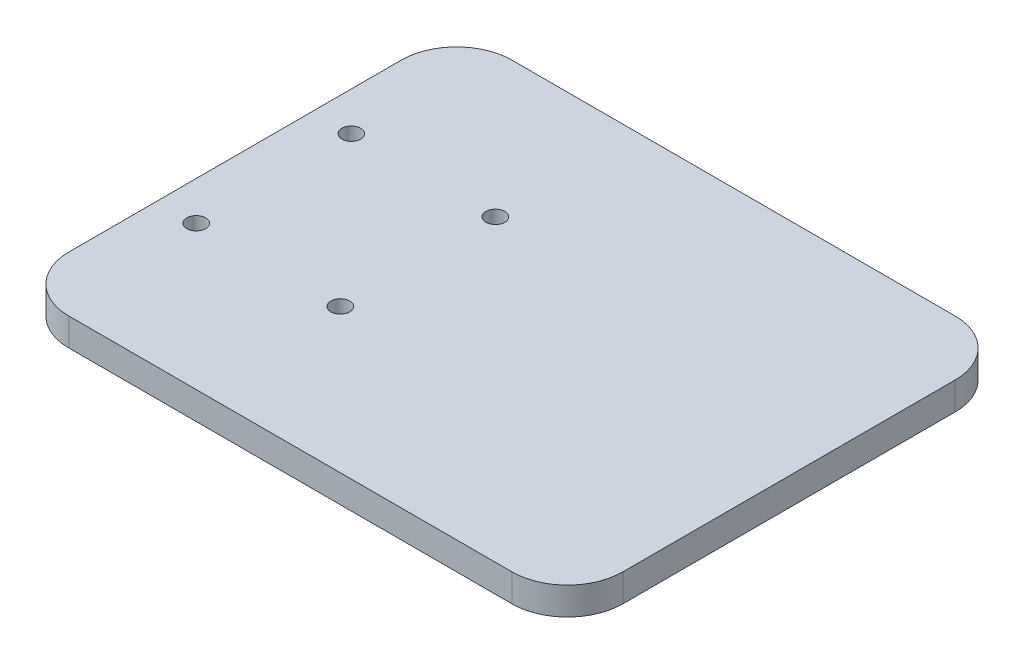
ISO-10303-21;
HEADER;
FILE_DESCRIPTION(('STEP AP214'),'2;1');
FILE_NAME('part.step','',(''),(''),'','','');
FILE_SCHEMA(('AUTOMOTIVE_DESIGN { 1 0 10303 214 1 1 1 1 }'));
ENDSEC;
DATA;
#1=APPLICATION_CONTEXT('core data for automotive mechanical design processes');
#2=APPLICATION_PROTOCOL_DEFINITION('international standard','automotive_design',2000,#1);
#3=PRODUCT_CONTEXT('',#1,'mechanical');
#4=PRODUCT('Part','Part','',(#3));
#5=PRODUCT_RELATED_PRODUCT_CATEGORY('part','',(#4));
#6=PRODUCT_DEFINITION_FORMATION('','',#4);
#7=PRODUCT_DEFINITION_CONTEXT('part definition',#1,'design');
#8=PRODUCT_DEFINITION('design','',#6,#7);
#9=PRODUCT_DEFINITION_SHAPE('','',#8);
#10=(LENGTH_UNIT() NAMED_UNIT(*) SI_UNIT(.MILLI.,.METRE.));
#11=(NAMED_UNIT(*) PLANE_ANGLE_UNIT() SI_UNIT($,.RADIAN.));
#12=(NAMED_UNIT(*) SI_UNIT($,.STERADIAN.) SOLID_ANGLE_UNIT());
#13=UNCERTAINTY_MEASURE_WITH_UNIT(LENGTH_MEASURE(1.E-05),#10,'distance_accuracy_value','');
#14=(GEOMETRIC_REPRESENTATION_CONTEXT(3) GLOBAL_UNCERTAINTY_ASSIGNED_CONTEXT((#13)) GLOBAL_UNIT_ASSIGNED_CONTEXT((#10,
#11,#12)) REPRESENTATION_CONTEXT('',''));
#15=CARTESIAN_POINT('',(0.,0.,0.));
#16=DIRECTION('',(0.,0.,1.));
#17=DIRECTION('',(1.,0.,0.));
#18=AXIS2_PLACEMENT_3D('',#15,#16,#17);
#19=CARTESIAN_POINT('',(0.,-5.,0.));
#20=DIRECTION('',(0.,1.,0.));
#21=DIRECTION('',(0.,0.,1.));
#22=AXIS2_PLACEMENT_3D('',#19,#20,#21);
#23=PLANE('',#22);
#24=CARTESIAN_POINT('',(13.,-5.,14.));
#25=DIRECTION('',(0.,1.,0.));
#26=DIRECTION('',(0.,0.,1.));
#27=AXIS2_PLACEMENT_3D('',#24,#25,#26);
#28=CIRCLE('',#27,1.69999999999999);
#29=CARTESIAN_POINT('',(13.,-5.,15.7));
#30=VERTEX_POINT('',#29);
#31=EDGE_CURVE('E267',#30,#30,#28,.F.);
#32=ORIENTED_EDGE('',*,*,#31,.F.);
#33=EDGE_LOOP('',(#32));
#34=FACE_BOUND('',#33,.T.);
#35=CARTESIAN_POINT('',(-13.,-5.,14.));
#36=DIRECTION('',(0.,1.,0.));
#37=DIRECTION('',(0.,0.,1.));
#38=AXIS2_PLACEMENT_3D('',#35,#36,#37);
#39=CIRCLE('',#38,1.69999999999999);
#40=CARTESIAN_POINT('',(-13.,-5.,15.7));
#41=VERTEX_POINT('',#40);
#42=EDGE_CURVE('E194',#41,#41,#39,.F.);
#43=ORIENTED_EDGE('',*,*,#42,.F.);
#44=EDGE_LOOP('',(#43));
#45=FACE_BOUND('',#44,.T.);
#46=DIRECTION('',(0.,0.,1.));
#47=VECTOR('',#46,1.);
#48=CARTESIAN_POINT('',(80.,-5.,-40.));
#49=LINE('',#48,#47);
#50=CARTESIAN_POINT('',(80.,-5.,-30.));
#51=VERTEX_POINT('',#50);
#52=CARTESIAN_POINT('',(80.,-5.,30.));
#53=VERTEX_POINT('',#52);
#54=EDGE_CURVE('E138',#51,#53,#49,.T.);
#55=ORIENTED_EDGE('',*,*,#54,.T.);
#56=CARTESIAN_POINT('',(70.,-5.,30.));
#57=DIRECTION('',(0.,1.,0.));
#58=DIRECTION('',(0.,0.,1.));
#59=AXIS2_PLACEMENT_3D('',#56,#57,#58);
#60=CIRCLE('',#59,10.);
#61=CARTESIAN_POINT('',(70.,-5.,40.));
#62=VERTEX_POINT('',#61);
#63=EDGE_CURVE('E166',#53,#62,#60,.F.);
#64=ORIENTED_EDGE('',*,*,#63,.T.);
#65=DIRECTION('',(1.,0.,0.));
#66=VECTOR('',#65,1.);
#67=CARTESIAN_POINT('',(-20.,-5.,40.));
#68=LINE('',#67,#66);
#69=CARTESIAN_POINT('',(-10.,-5.,40.));
#70=VERTEX_POINT('',#69);
#71=EDGE_CURVE('E181',#70,#62,#68,.T.);
#72=ORIENTED_EDGE('',*,*,#71,.F.);
#73=CARTESIAN_POINT('',(-10.,-5.,30.));
#74=DIRECTION('',(0.,1.,0.));
#75=DIRECTION('',(0.,0.,1.));
#76=AXIS2_PLACEMENT_3D('',#73,#74,#75);
#77=CIRCLE('',#76,10.);
#78=CARTESIAN_POINT('',(-20.,-5.,30.));
#79=VERTEX_POINT('',#78);
#80=EDGE_CURVE('E131',#70,#79,#77,.F.);
#81=ORIENTED_EDGE('',*,*,#80,.T.);
#82=DIRECTION('',(0.,0.,1.));
#83=VECTOR('',#82,1.);
#84=CARTESIAN_POINT('',(-20.,-5.,-40.));
#85=LINE('',#84,#83);
#86=CARTESIAN_POINT('',(-20.,-5.,-30.));
#87=VERTEX_POINT('',#86);
#88=EDGE_CURVE('E179',#87,#79,#85,.T.);
#89=ORIENTED_EDGE('',*,*,#88,.F.);
#90=CARTESIAN_POINT('',(-10.,-5.,-30.));
#91=DIRECTION('',(0.,1.,0.));
#92=DIRECTION('',(0.,0.,1.));
#93=AXIS2_PLACEMENT_3D('',#90,#91,#92);
#94=CIRCLE('',#93,10.);
#95=CARTESIAN_POINT('',(-10.,-5.,-40.));
#96=VERTEX_POINT('',#95);
#97=EDGE_CURVE('E62',#87,#96,#94,.F.);
#98=ORIENTED_EDGE('',*,*,#97,.T.);
#99=DIRECTION('',(1.,0.,0.));
#100=VECTOR('',#99,1.);
#101=CARTESIAN_POINT('',(-20.,-5.,-40.));
#102=LINE('',#101,#100);
#103=CARTESIAN_POINT('',(70.,-5.,-40.));
#104=VERTEX_POINT('',#103);
#105=EDGE_CURVE('E133',#96,#104,#102,.T.);
#106=ORIENTED_EDGE('',*,*,#105,.T.);
#107=CARTESIAN_POINT('',(70.,-5.,-30.));
#108=DIRECTION('',(0.,1.,0.));
#109=DIRECTION('',(0.,0.,1.));
#110=AXIS2_PLACEMENT_3D('',#107,#108,#109);
#111=CIRCLE('',#110,10.);
#112=EDGE_CURVE('E163',#104,#51,#111,.F.);
#113=ORIENTED_EDGE('',*,*,#112,.T.);
#114=EDGE_LOOP('',(#55,#64,#72,#81,#89,#98,#106,#113));
#115=FACE_BOUND('',#114,.T.);
#116=CARTESIAN_POINT('',(13.,-5.,-14.));
#117=DIRECTION('',(0.,1.,0.));
#118=DIRECTION('',(0.,0.,1.));
#119=AXIS2_PLACEMENT_3D('',#116,#117,#118);
#120=CIRCLE('',#119,1.69999999999999);
#121=CARTESIAN_POINT('',(13.,-5.,-12.3));
#122=VERTEX_POINT('',#121);
#123=EDGE_CURVE('E273',#122,#122,#120,.F.);
#124=ORIENTED_EDGE('',*,*,#123,.F.);
#125=EDGE_LOOP('',(#124));
#126=FACE_BOUND('',#125,.T.);
#127=CARTESIAN_POINT('',(-13.,-5.,-14.));
#128=DIRECTION('',(0.,1.,0.));
#129=DIRECTION('',(0.,0.,1.));
#130=AXIS2_PLACEMENT_3D('',#127,#128,#129);
#131=CIRCLE('',#130,1.69999999999999);
#132=CARTESIAN_POINT('',(-13.,-5.,-12.3));
#133=VERTEX_POINT('',#132);
#134=EDGE_CURVE('E292',#133,#133,#131,.F.);
#135=ORIENTED_EDGE('',*,*,#134,.F.);
#136=EDGE_LOOP('',(#135));
#137=FACE_BOUND('',#136,.T.);
#138=ADVANCED_FACE('F39',(#34,#45,#115,#126,#137),#23,.F.);
#139=CARTESIAN_POINT('',(-20.,-5.,-40.));
#140=DIRECTION('',(-1.,0.,0.));
#141=DIRECTION('',(0.,0.,1.));
#142=AXIS2_PLACEMENT_3D('',#139,#140,#141);
#143=PLANE('',#142);
#144=DIRECTION('',(0.,0.,1.));
#145=VECTOR('',#144,1.);
#146=CARTESIAN_POINT('',(-20.,0.,-40.));
#147=LINE('',#146,#145);
#148=CARTESIAN_POINT('',(-20.,0.,-30.));
#149=VERTEX_POINT('',#148);
#150=CARTESIAN_POINT('',(-20.,0.,30.));
#151=VERTEX_POINT('',#150);
#152=EDGE_CURVE('E111',#149,#151,#147,.T.);
#153=ORIENTED_EDGE('',*,*,#152,.F.);
#154=DIRECTION('',(0.,1.,0.));
#155=VECTOR('',#154,1.);
#156=CARTESIAN_POINT('',(-20.,-5.,-30.));
#157=LINE('',#156,#155);
#158=EDGE_CURVE('E11',#149,#87,#157,.F.);
#159=ORIENTED_EDGE('',*,*,#158,.T.);
#160=ORIENTED_EDGE('',*,*,#88,.T.);
#161=DIRECTION('',(0.,1.,0.));
#162=VECTOR('',#161,1.);
#163=CARTESIAN_POINT('',(-20.,-5.,30.));
#164=LINE('',#163,#162);
#165=EDGE_CURVE('E48',#79,#151,#164,.T.);
#166=ORIENTED_EDGE('',*,*,#165,.T.);
#167=EDGE_LOOP('',(#153,#159,#160,#166));
#168=FACE_BOUND('',#167,.T.);
#169=ADVANCED_FACE('F177',(#168),#143,.T.);
#170=CARTESIAN_POINT('',(-20.,-5.,-40.));
#171=DIRECTION('',(0.,0.,1.));
#172=DIRECTION('',(1.,0.,0.));
#173=AXIS2_PLACEMENT_3D('',#170,#171,#172);
#174=PLANE('',#173);
#175=DIRECTION('',(1.,0.,0.));
#176=VECTOR('',#175,1.);
#177=CARTESIAN_POINT('',(-20.,0.,-40.));
#178=LINE('',#177,#176);
#179=CARTESIAN_POINT('',(-10.,0.,-40.));
#180=VERTEX_POINT('',#179);
#181=CARTESIAN_POINT('',(70.,0.,-40.));
#182=VERTEX_POINT('',#181);
#183=EDGE_CURVE('E141',#180,#182,#178,.T.);
#184=ORIENTED_EDGE('',*,*,#183,.T.);
#185=DIRECTION('',(0.,1.,0.));
#186=VECTOR('',#185,1.);
#187=CARTESIAN_POINT('',(70.,-5.,-40.));
#188=LINE('',#187,#186);
#189=EDGE_CURVE('E55',#182,#104,#188,.F.);
#190=ORIENTED_EDGE('',*,*,#189,.T.);
#191=ORIENTED_EDGE('',*,*,#105,.F.);
#192=DIRECTION('',(0.,1.,0.));
#193=VECTOR('',#192,1.);
#194=CARTESIAN_POINT('',(-10.,0.,-40.));
#195=LINE('',#194,#193);
#196=EDGE_CURVE('E169',#96,#180,#195,.T.);
#197=ORIENTED_EDGE('',*,*,#196,.T.);
#198=EDGE_LOOP('',(#184,#190,#191,#197));
#199=FACE_BOUND('',#198,.T.);
#200=ADVANCED_FACE('F211',(#199),#174,.F.);
#201=CARTESIAN_POINT('',(80.,-5.,-40.));
#202=DIRECTION('',(-1.,0.,0.));
#203=DIRECTION('',(0.,0.,1.));
#204=AXIS2_PLACEMENT_3D('',#201,#202,#203);
#205=PLANE('',#204);
#206=DIRECTION('',(0.,0.,1.));
#207=VECTOR('',#206,1.);
#208=CARTESIAN_POINT('',(80.,0.,-40.));
#209=LINE('',#208,#207);
#210=CARTESIAN_POINT('',(80.,0.,-30.));
#211=VERTEX_POINT('',#210);
#212=CARTESIAN_POINT('',(80.,0.,30.));
#213=VERTEX_POINT('',#212);
#214=EDGE_CURVE('E128',#211,#213,#209,.T.);
#215=ORIENTED_EDGE('',*,*,#214,.T.);
#216=DIRECTION('',(0.,1.,0.));
#217=VECTOR('',#216,1.);
#218=CARTESIAN_POINT('',(80.,-5.,30.));
#219=LINE('',#218,#217);
#220=EDGE_CURVE('E156',#213,#53,#219,.F.);
#221=ORIENTED_EDGE('',*,*,#220,.T.);
#222=ORIENTED_EDGE('',*,*,#54,.F.);
#223=DIRECTION('',(0.,1.,0.));
#224=VECTOR('',#223,1.);
#225=CARTESIAN_POINT('',(80.,-5.,-30.));
#226=LINE('',#225,#224);
#227=EDGE_CURVE('E152',#51,#211,#226,.T.);
#228=ORIENTED_EDGE('',*,*,#227,.T.);
#229=EDGE_LOOP('',(#215,#221,#222,#228));
#230=FACE_BOUND('',#229,.T.);
#231=ADVANCED_FACE('F200',(#230),#205,.F.);
#232=CARTESIAN_POINT('',(-20.,-5.,40.));
#233=DIRECTION('',(0.,0.,1.));
#234=DIRECTION('',(1.,0.,0.));
#235=AXIS2_PLACEMENT_3D('',#232,#233,#234);
#236=PLANE('',#235);
#237=ORIENTED_EDGE('',*,*,#71,.T.);
#238=DIRECTION('',(0.,1.,0.));
#239=VECTOR('',#238,1.);
#240=CARTESIAN_POINT('',(70.,0.,40.));
#241=LINE('',#240,#239);
#242=CARTESIAN_POINT('',(70.,0.,40.));
#243=VERTEX_POINT('',#242);
#244=EDGE_CURVE('E118',#62,#243,#241,.T.);
#245=ORIENTED_EDGE('',*,*,#244,.T.);
#246=DIRECTION('',(1.,0.,0.));
#247=VECTOR('',#246,1.);
#248=CARTESIAN_POINT('',(-20.,0.,40.));
#249=LINE('',#248,#247);
#250=CARTESIAN_POINT('',(-10.,0.,40.));
#251=VERTEX_POINT('',#250);
#252=EDGE_CURVE('E109',#251,#243,#249,.T.);
#253=ORIENTED_EDGE('',*,*,#252,.F.);
#254=DIRECTION('',(0.,1.,0.));
#255=VECTOR('',#254,1.);
#256=CARTESIAN_POINT('',(-10.,-5.,40.));
#257=LINE('',#256,#255);
#258=EDGE_CURVE('E124',#251,#70,#257,.F.);
#259=ORIENTED_EDGE('',*,*,#258,.T.);
#260=EDGE_LOOP('',(#237,#245,#253,#259));
#261=FACE_BOUND('',#260,.T.);
#262=ADVANCED_FACE('F123',(#261),#236,.T.);
#263=CARTESIAN_POINT('',(0.,0.,0.));
#264=DIRECTION('',(0.,1.,0.));
#265=DIRECTION('',(0.,0.,1.));
#266=AXIS2_PLACEMENT_3D('',#263,#264,#265);
#267=PLANE('',#266);
#268=CARTESIAN_POINT('',(-13.,0.,-14.));
#269=DIRECTION('',(0.,1.,0.));
#270=DIRECTION('',(0.,0.,1.));
#271=AXIS2_PLACEMENT_3D('',#268,#269,#270);
#272=CIRCLE('',#271,1.69999999999999);
#273=CARTESIAN_POINT('',(-13.,0.,-12.3));
#274=VERTEX_POINT('',#273);
#275=EDGE_CURVE('E294',#274,#274,#272,.T.);
#276=ORIENTED_EDGE('',*,*,#275,.F.);
#277=EDGE_LOOP('',(#276));
#278=FACE_BOUND('',#277,.T.);
#279=CARTESIAN_POINT('',(13.,0.,-14.));
#280=DIRECTION('',(0.,1.,0.));
#281=DIRECTION('',(0.,0.,1.));
#282=AXIS2_PLACEMENT_3D('',#279,#280,#281);
#283=CIRCLE('',#282,1.69999999999999);
#284=CARTESIAN_POINT('',(13.,0.,-12.3));
#285=VERTEX_POINT('',#284);
#286=EDGE_CURVE('E279',#285,#285,#283,.T.);
#287=ORIENTED_EDGE('',*,*,#286,.F.);
#288=EDGE_LOOP('',(#287));
#289=FACE_BOUND('',#288,.T.);
#290=CARTESIAN_POINT('',(13.,0.,14.));
#291=DIRECTION('',(0.,1.,0.));
#292=DIRECTION('',(0.,0.,1.));
#293=AXIS2_PLACEMENT_3D('',#290,#291,#292);
#294=CIRCLE('',#293,1.69999999999999);
#295=CARTESIAN_POINT('',(13.,0.,15.7));
#296=VERTEX_POINT('',#295);
#297=EDGE_CURVE('E270',#296,#296,#294,.T.);
#298=ORIENTED_EDGE('',*,*,#297,.F.);
#299=EDGE_LOOP('',(#298));
#300=FACE_BOUND('',#299,.T.);
#301=CARTESIAN_POINT('',(-13.,0.,14.));
#302=DIRECTION('',(0.,1.,0.));
#303=DIRECTION('',(0.,0.,1.));
#304=AXIS2_PLACEMENT_3D('',#301,#302,#303);
#305=CIRCLE('',#304,1.69999999999999);
#306=CARTESIAN_POINT('',(-13.,0.,15.7));
#307=VERTEX_POINT('',#306);
#308=EDGE_CURVE('E187',#307,#307,#305,.T.);
#309=ORIENTED_EDGE('',*,*,#308,.F.);
#310=EDGE_LOOP('',(#309));
#311=FACE_BOUND('',#310,.T.);
#312=ORIENTED_EDGE('',*,*,#252,.T.);
#313=CARTESIAN_POINT('',(70.,0.,30.));
#314=DIRECTION('',(0.,1.,0.));
#315=DIRECTION('',(0.,0.,1.));
#316=AXIS2_PLACEMENT_3D('',#313,#314,#315);
#317=CIRCLE('',#316,10.);
#318=EDGE_CURVE('E149',#243,#213,#317,.T.);
#319=ORIENTED_EDGE('',*,*,#318,.T.);
#320=ORIENTED_EDGE('',*,*,#214,.F.);
#321=CARTESIAN_POINT('',(70.,0.,-30.));
#322=DIRECTION('',(0.,1.,0.));
#323=DIRECTION('',(0.,0.,1.));
#324=AXIS2_PLACEMENT_3D('',#321,#322,#323);
#325=CIRCLE('',#324,10.);
#326=EDGE_CURVE('E146',#211,#182,#325,.T.);
#327=ORIENTED_EDGE('',*,*,#326,.T.);
#328=ORIENTED_EDGE('',*,*,#183,.F.);
#329=CARTESIAN_POINT('',(-10.,0.,-30.));
#330=DIRECTION('',(0.,1.,0.));
#331=DIRECTION('',(0.,0.,1.));
#332=AXIS2_PLACEMENT_3D('',#329,#330,#331);
#333=CIRCLE('',#332,10.);
#334=EDGE_CURVE('E117',#180,#149,#333,.T.);
#335=ORIENTED_EDGE('',*,*,#334,.T.);
#336=ORIENTED_EDGE('',*,*,#152,.T.);
#337=CARTESIAN_POINT('',(-10.,0.,30.));
#338=DIRECTION('',(0.,1.,0.));
#339=DIRECTION('',(0.,0.,1.));
#340=AXIS2_PLACEMENT_3D('',#337,#338,#339);
#341=CIRCLE('',#340,10.);
#342=EDGE_CURVE('E106',#151,#251,#341,.T.);
#343=ORIENTED_EDGE('',*,*,#342,.T.);
#344=EDGE_LOOP('',(#312,#319,#320,#327,#328,#335,#336,#343));
#345=FACE_BOUND('',#344,.T.);
#346=ADVANCED_FACE('F108',(#278,#289,#300,#311,#345),#267,.T.);
#347=CARTESIAN_POINT('',(-13.,0.,14.));
#348=DIRECTION('',(0.,1.,0.));
#349=DIRECTION('',(0.,0.,1.));
#350=AXIS2_PLACEMENT_3D('',#347,#348,#349);
#351=CYLINDRICAL_SURFACE('',#350,1.69999999999999);
#352=ORIENTED_EDGE('',*,*,#42,.T.);
#353=EDGE_LOOP('',(#352));
#354=FACE_BOUND('',#353,.T.);
#355=ORIENTED_EDGE('',*,*,#308,.T.);
#356=EDGE_LOOP('',(#355));
#357=FACE_BOUND('',#356,.T.);
#358=ADVANCED_FACE('F232',(#354,#357),#351,.F.);
#359=CARTESIAN_POINT('',(13.,0.,14.));
#360=DIRECTION('',(0.,1.,0.));
#361=DIRECTION('',(0.,0.,1.));
#362=AXIS2_PLACEMENT_3D('',#359,#360,#361);
#363=CYLINDRICAL_SURFACE('',#362,1.69999999999999);
#364=ORIENTED_EDGE('',*,*,#31,.T.);
#365=EDGE_LOOP('',(#364));
#366=FACE_BOUND('',#365,.T.);
#367=ORIENTED_EDGE('',*,*,#297,.T.);
#368=EDGE_LOOP('',(#367));
#369=FACE_BOUND('',#368,.T.);
#370=ADVANCED_FACE('F254',(#366,#369),#363,.F.);
#371=CARTESIAN_POINT('',(13.,0.,-14.));
#372=DIRECTION('',(0.,1.,0.));
#373=DIRECTION('',(0.,0.,1.));
#374=AXIS2_PLACEMENT_3D('',#371,#372,#373);
#375=CYLINDRICAL_SURFACE('',#374,1.69999999999999);
#376=ORIENTED_EDGE('',*,*,#123,.T.);
#377=EDGE_LOOP('',(#376));
#378=FACE_BOUND('',#377,.T.);
#379=ORIENTED_EDGE('',*,*,#286,.T.);
#380=EDGE_LOOP('',(#379));
#381=FACE_BOUND('',#380,.T.);
#382=ADVANCED_FACE('F248',(#378,#381),#375,.F.);
#383=CARTESIAN_POINT('',(-13.,0.,-14.));
#384=DIRECTION('',(0.,1.,0.));
#385=DIRECTION('',(0.,0.,1.));
#386=AXIS2_PLACEMENT_3D('',#383,#384,#385);
#387=CYLINDRICAL_SURFACE('',#386,1.69999999999999);
#388=ORIENTED_EDGE('',*,*,#134,.T.);
#389=EDGE_LOOP('',(#388));
#390=FACE_BOUND('',#389,.T.);
#391=ORIENTED_EDGE('',*,*,#275,.T.);
#392=EDGE_LOOP('',(#391));
#393=FACE_BOUND('',#392,.T.);
#394=ADVANCED_FACE('F244',(#390,#393),#387,.F.);
#395=CARTESIAN_POINT('',(70.,-5.,30.));
#396=DIRECTION('',(0.,-1.,0.));
#397=DIRECTION('',(0.,0.,-1.));
#398=AXIS2_PLACEMENT_3D('',#395,#396,#397);
#399=CYLINDRICAL_SURFACE('',#398,10.);
#400=ORIENTED_EDGE('',*,*,#63,.F.);
#401=ORIENTED_EDGE('',*,*,#220,.F.);
#402=ORIENTED_EDGE('',*,*,#318,.F.);
#403=ORIENTED_EDGE('',*,*,#244,.F.);
#404=EDGE_LOOP('',(#400,#401,#402,#403));
#405=FACE_BOUND('',#404,.T.);
#406=ADVANCED_FACE('F205',(#405),#399,.T.);
#407=CARTESIAN_POINT('',(70.,-5.,-30.));
#408=DIRECTION('',(0.,1.,0.));
#409=DIRECTION('',(0.,0.,1.));
#410=AXIS2_PLACEMENT_3D('',#407,#408,#409);
#411=CYLINDRICAL_SURFACE('',#410,10.);
#412=ORIENTED_EDGE('',*,*,#112,.F.);
#413=ORIENTED_EDGE('',*,*,#189,.F.);
#414=ORIENTED_EDGE('',*,*,#326,.F.);
#415=ORIENTED_EDGE('',*,*,#227,.F.);
#416=EDGE_LOOP('',(#412,#413,#414,#415));
#417=FACE_BOUND('',#416,.T.);
#418=ADVANCED_FACE('F209',(#417),#411,.T.);
#419=CARTESIAN_POINT('',(-10.,-5.,-30.));
#420=DIRECTION('',(0.,-1.,0.));
#421=DIRECTION('',(0.,0.,-1.));
#422=AXIS2_PLACEMENT_3D('',#419,#420,#421);
#423=CYLINDRICAL_SURFACE('',#422,10.);
#424=ORIENTED_EDGE('',*,*,#97,.F.);
#425=ORIENTED_EDGE('',*,*,#158,.F.);
#426=ORIENTED_EDGE('',*,*,#334,.F.);
#427=ORIENTED_EDGE('',*,*,#196,.F.);
#428=EDGE_LOOP('',(#424,#425,#426,#427));
#429=FACE_BOUND('',#428,.T.);
#430=ADVANCED_FACE('F214',(#429),#423,.T.);
#431=CARTESIAN_POINT('',(-10.,-5.,30.));
#432=DIRECTION('',(0.,1.,0.));
#433=DIRECTION('',(0.,0.,1.));
#434=AXIS2_PLACEMENT_3D('',#431,#432,#433);
#435=CYLINDRICAL_SURFACE('',#434,10.);
#436=ORIENTED_EDGE('',*,*,#80,.F.);
#437=ORIENTED_EDGE('',*,*,#258,.F.);
#438=ORIENTED_EDGE('',*,*,#342,.F.);
#439=ORIENTED_EDGE('',*,*,#165,.F.);
#440=EDGE_LOOP('',(#436,#437,#438,#439));
#441=FACE_BOUND('',#440,.T.);
#442=ADVANCED_FACE('F41',(#441),#435,.T.);
#443=CLOSED_SHELL('',(#138,#169,#200,#231,#262,#346,#358,#370,#382,#394,#406,#418,#430,#442));
#444=MANIFOLD_SOLID_BREP('B2',#443);
#445=ADVANCED_BREP_SHAPE_REPRESENTATION('',(#18,#444),#14);
#446=SHAPE_DEFINITION_REPRESENTATION(#9,#445);
ENDSEC;
END-ISO-10303-21;
